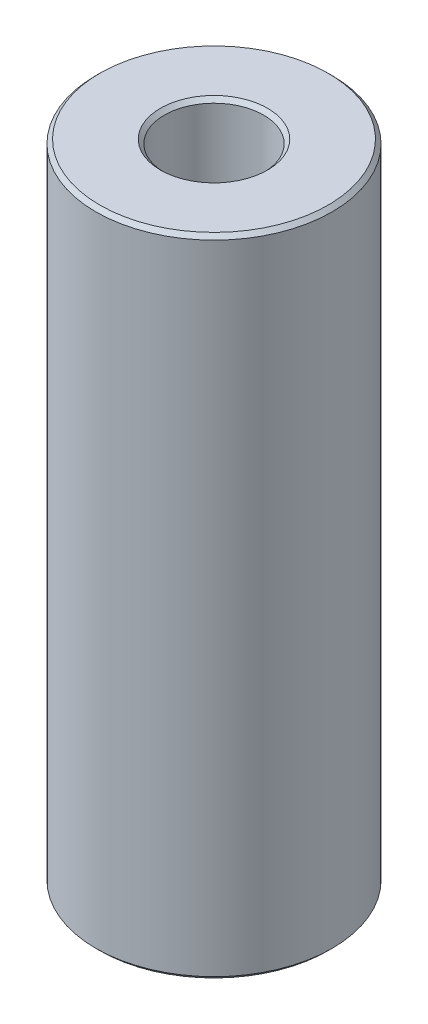
ISO-10303-21;
HEADER;
FILE_DESCRIPTION(('STEP AP214'),'2;1');
FILE_NAME('part.step','',(''),(''),'','','');
FILE_SCHEMA(('AUTOMOTIVE_DESIGN { 1 0 10303 214 1 1 1 1 }'));
ENDSEC;
DATA;
#1=APPLICATION_CONTEXT('core data for automotive mechanical design processes');
#2=APPLICATION_PROTOCOL_DEFINITION('international standard','automotive_design',2000,#1);
#3=PRODUCT_CONTEXT('',#1,'mechanical');
#4=PRODUCT('Part','Part','',(#3));
#5=PRODUCT_RELATED_PRODUCT_CATEGORY('part','',(#4));
#6=PRODUCT_DEFINITION_FORMATION('','',#4);
#7=PRODUCT_DEFINITION_CONTEXT('part definition',#1,'design');
#8=PRODUCT_DEFINITION('design','',#6,#7);
#9=PRODUCT_DEFINITION_SHAPE('','',#8);
#10=(LENGTH_UNIT() NAMED_UNIT(*) SI_UNIT(.MILLI.,.METRE.));
#11=(NAMED_UNIT(*) PLANE_ANGLE_UNIT() SI_UNIT($,.RADIAN.));
#12=(NAMED_UNIT(*) SI_UNIT($,.STERADIAN.) SOLID_ANGLE_UNIT());
#13=UNCERTAINTY_MEASURE_WITH_UNIT(LENGTH_MEASURE(1.E-05),#10,'distance_accuracy_value','');
#14=(GEOMETRIC_REPRESENTATION_CONTEXT(3) GLOBAL_UNCERTAINTY_ASSIGNED_CONTEXT((#13)) GLOBAL_UNIT_ASSIGNED_CONTEXT((#10,
#11,#12)) REPRESENTATION_CONTEXT('',''));
#15=CARTESIAN_POINT('',(0.,0.,0.));
#16=DIRECTION('',(0.,0.,1.));
#17=DIRECTION('',(1.,0.,0.));
#18=AXIS2_PLACEMENT_3D('',#15,#16,#17);
#19=CARTESIAN_POINT('',(0.,327.974703964131,0.));
#20=DIRECTION('',(0.,-1.,0.));
#21=DIRECTION('',(0.,0.,-1.));
#22=AXIS2_PLACEMENT_3D('',#19,#20,#21);
#23=CYLINDRICAL_SURFACE('',#22,60.);
#24=CARTESIAN_POINT('',(0.,2.00017420080845,0.));
#25=DIRECTION('',(0.,1.,0.));
#26=DIRECTION('',(0.,0.,1.));
#27=AXIS2_PLACEMENT_3D('',#24,#25,#26);
#28=CIRCLE('',#27,60.);
#29=CARTESIAN_POINT('',(0.,2.00017420080845,60.));
#30=VERTEX_POINT('',#29);
#31=EDGE_CURVE('E10',#30,#30,#28,.T.);
#32=ORIENTED_EDGE('',*,*,#31,.T.);
#33=EDGE_LOOP('',(#32));
#34=FACE_BOUND('',#33,.T.);
#35=CARTESIAN_POINT('',(0.,325.974529763323,0.));
#36=DIRECTION('',(0.,1.,0.));
#37=DIRECTION('',(0.,0.,1.));
#38=AXIS2_PLACEMENT_3D('',#35,#36,#37);
#39=CIRCLE('',#38,60.);
#40=CARTESIAN_POINT('',(0.,325.974529763323,60.));
#41=VERTEX_POINT('',#40);
#42=EDGE_CURVE('E50',#41,#41,#39,.F.);
#43=ORIENTED_EDGE('',*,*,#42,.T.);
#44=EDGE_LOOP('',(#43));
#45=FACE_BOUND('',#44,.T.);
#46=ADVANCED_FACE('F39',(#34,#45),#23,.T.);
#47=CARTESIAN_POINT('',(0.,327.974703964131,0.));
#48=DIRECTION('',(0.,1.,0.));
#49=DIRECTION('',(0.,0.,1.));
#50=AXIS2_PLACEMENT_3D('',#47,#48,#49);
#51=PLANE('',#50);
#52=CARTESIAN_POINT('',(0.,327.974703964131,0.));
#53=DIRECTION('',(0.,1.,0.));
#54=DIRECTION('',(0.,0.,1.));
#55=AXIS2_PLACEMENT_3D('',#52,#53,#54);
#56=CIRCLE('',#55,27.2184228347927);
#57=CARTESIAN_POINT('',(0.,327.974703964131,27.2184228347927));
#58=VERTEX_POINT('',#57);
#59=EDGE_CURVE('E58',#58,#58,#56,.F.);
#60=ORIENTED_EDGE('',*,*,#59,.T.);
#61=EDGE_LOOP('',(#60));
#62=FACE_BOUND('',#61,.T.);
#63=CARTESIAN_POINT('',(0.,327.974703964131,0.));
#64=DIRECTION('',(0.,1.,0.));
#65=DIRECTION('',(0.,0.,1.));
#66=AXIS2_PLACEMENT_3D('',#63,#64,#65);
#67=CIRCLE('',#66,57.9998257991916);
#68=CARTESIAN_POINT('',(0.,327.974703964131,57.9998257991916));
#69=VERTEX_POINT('',#68);
#70=EDGE_CURVE('E61',#69,#69,#67,.T.);
#71=ORIENTED_EDGE('',*,*,#70,.T.);
#72=EDGE_LOOP('',(#71));
#73=FACE_BOUND('',#72,.T.);
#74=ADVANCED_FACE('F88',(#62,#73),#51,.T.);
#75=CARTESIAN_POINT('',(0.,0.,0.));
#76=DIRECTION('',(0.,1.,0.));
#77=DIRECTION('',(0.,0.,1.));
#78=AXIS2_PLACEMENT_3D('',#75,#76,#77);
#79=PLANE('',#78);
#80=CARTESIAN_POINT('',(0.,0.,0.));
#81=DIRECTION('',(0.,1.,0.));
#82=DIRECTION('',(0.,0.,1.));
#83=AXIS2_PLACEMENT_3D('',#80,#81,#82);
#84=CIRCLE('',#83,27.2184228347927);
#85=CARTESIAN_POINT('',(0.,0.,27.2184228347927));
#86=VERTEX_POINT('',#85);
#87=EDGE_CURVE('E51',#86,#86,#84,.T.);
#88=ORIENTED_EDGE('',*,*,#87,.T.);
#89=EDGE_LOOP('',(#88));
#90=FACE_BOUND('',#89,.T.);
#91=CARTESIAN_POINT('',(0.,0.,0.));
#92=DIRECTION('',(0.,1.,0.));
#93=DIRECTION('',(0.,0.,1.));
#94=AXIS2_PLACEMENT_3D('',#91,#92,#93);
#95=CIRCLE('',#94,57.9998257991915);
#96=CARTESIAN_POINT('',(0.,0.,57.9998257991915));
#97=VERTEX_POINT('',#96);
#98=EDGE_CURVE('E54',#97,#97,#95,.F.);
#99=ORIENTED_EDGE('',*,*,#98,.T.);
#100=EDGE_LOOP('',(#99));
#101=FACE_BOUND('',#100,.T.);
#102=ADVANCED_FACE('F83',(#90,#101),#79,.F.);
#103=CARTESIAN_POINT('',(0.,327.974703964131,0.));
#104=DIRECTION('',(0.,-1.,0.));
#105=DIRECTION('',(0.,0.,-1.));
#106=AXIS2_PLACEMENT_3D('',#103,#104,#105);
#107=CYLINDRICAL_SURFACE('',#106,25.2182486339842);
#108=CARTESIAN_POINT('',(0.,325.974529763323,0.));
#109=DIRECTION('',(0.,1.,0.));
#110=DIRECTION('',(0.,0.,1.));
#111=AXIS2_PLACEMENT_3D('',#108,#109,#110);
#112=CIRCLE('',#111,25.2182486339842);
#113=CARTESIAN_POINT('',(0.,325.974529763323,25.2182486339842));
#114=VERTEX_POINT('',#113);
#115=EDGE_CURVE('E67',#114,#114,#112,.T.);
#116=ORIENTED_EDGE('',*,*,#115,.T.);
#117=EDGE_LOOP('',(#116));
#118=FACE_BOUND('',#117,.T.);
#119=CARTESIAN_POINT('',(0.,2.00017420080845,0.));
#120=DIRECTION('',(0.,1.,0.));
#121=DIRECTION('',(0.,0.,1.));
#122=AXIS2_PLACEMENT_3D('',#119,#120,#121);
#123=CIRCLE('',#122,25.2182486339842);
#124=CARTESIAN_POINT('',(0.,2.00017420080845,25.2182486339842));
#125=VERTEX_POINT('',#124);
#126=EDGE_CURVE('E69',#125,#125,#123,.F.);
#127=ORIENTED_EDGE('',*,*,#126,.T.);
#128=EDGE_LOOP('',(#127));
#129=FACE_BOUND('',#128,.T.);
#130=ADVANCED_FACE('F71',(#118,#129),#107,.F.);
#131=CARTESIAN_POINT('',(0.,325.974529763323,0.));
#132=DIRECTION('',(0.,1.,0.));
#133=DIRECTION('',(0.,0.,1.));
#134=AXIS2_PLACEMENT_3D('',#131,#132,#133);
#135=CONICAL_SURFACE('',#134,25.2182486339842,0.785398163397453);
#136=ORIENTED_EDGE('',*,*,#59,.F.);
#137=EDGE_LOOP('',(#136));
#138=FACE_BOUND('',#137,.T.);
#139=ORIENTED_EDGE('',*,*,#115,.F.);
#140=EDGE_LOOP('',(#139));
#141=FACE_BOUND('',#140,.T.);
#142=ADVANCED_FACE('F77',(#138,#141),#135,.F.);
#143=CARTESIAN_POINT('',(0.,0.,0.));
#144=DIRECTION('',(0.,-1.,0.));
#145=DIRECTION('',(0.,0.,-1.));
#146=AXIS2_PLACEMENT_3D('',#143,#144,#145);
#147=CONICAL_SURFACE('',#146,27.2184228347927,0.785398163397452);
#148=ORIENTED_EDGE('',*,*,#126,.F.);
#149=EDGE_LOOP('',(#148));
#150=FACE_BOUND('',#149,.T.);
#151=ORIENTED_EDGE('',*,*,#87,.F.);
#152=EDGE_LOOP('',(#151));
#153=FACE_BOUND('',#152,.T.);
#154=ADVANCED_FACE('F73',(#150,#153),#147,.F.);
#155=CARTESIAN_POINT('',(0.,2.00017420080845,0.));
#156=DIRECTION('',(0.,1.,0.));
#157=DIRECTION('',(0.,0.,1.));
#158=AXIS2_PLACEMENT_3D('',#155,#156,#157);
#159=CONICAL_SURFACE('',#158,60.,0.785398163397455);
#160=ORIENTED_EDGE('',*,*,#98,.F.);
#161=EDGE_LOOP('',(#160));
#162=FACE_BOUND('',#161,.T.);
#163=ORIENTED_EDGE('',*,*,#31,.F.);
#164=EDGE_LOOP('',(#163));
#165=FACE_BOUND('',#164,.T.);
#166=ADVANCED_FACE('F76',(#162,#165),#159,.T.);
#167=CARTESIAN_POINT('',(0.,327.974703964131,0.));
#168=DIRECTION('',(0.,-1.,0.));
#169=DIRECTION('',(0.,0.,-1.));
#170=AXIS2_PLACEMENT_3D('',#167,#168,#169);
#171=CONICAL_SURFACE('',#170,57.9998257991916,0.785398163397435);
#172=ORIENTED_EDGE('',*,*,#42,.F.);
#173=EDGE_LOOP('',(#172));
#174=FACE_BOUND('',#173,.T.);
#175=ORIENTED_EDGE('',*,*,#70,.F.);
#176=EDGE_LOOP('',(#175));
#177=FACE_BOUND('',#176,.T.);
#178=ADVANCED_FACE('F45',(#174,#177),#171,.T.);
#179=CLOSED_SHELL('',(#46,#74,#102,#130,#142,#154,#166,#178));
#180=MANIFOLD_SOLID_BREP('B2',#179);
#181=ADVANCED_BREP_SHAPE_REPRESENTATION('',(#18,#180),#14);
#182=SHAPE_DEFINITION_REPRESENTATION(#9,#181);
ENDSEC;
END-ISO-10303-21;
